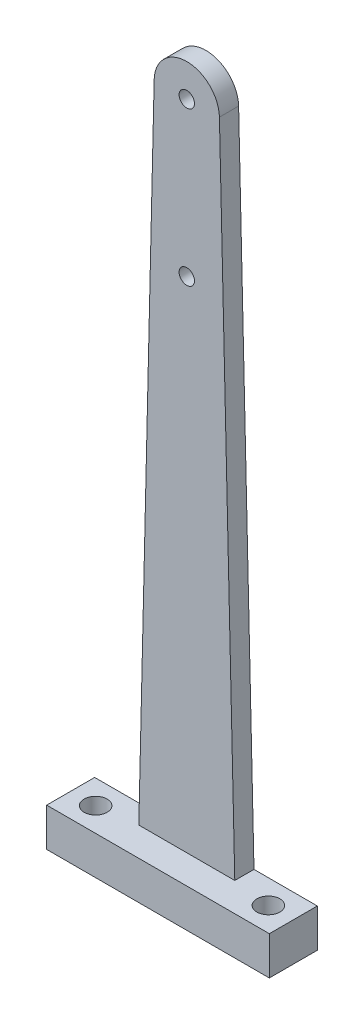
ISO-10303-21;
HEADER;
FILE_DESCRIPTION(('STEP AP214'),'2;1');
FILE_NAME('part.step','',(''),(''),'','','');
FILE_SCHEMA(('AUTOMOTIVE_DESIGN { 1 0 10303 214 1 1 1 1 }'));
ENDSEC;
DATA;
#1=APPLICATION_CONTEXT('core data for automotive mechanical design processes');
#2=APPLICATION_PROTOCOL_DEFINITION('international standard','automotive_design',2000,#1);
#3=PRODUCT_CONTEXT('',#1,'mechanical');
#4=PRODUCT('Part','Part','',(#3));
#5=PRODUCT_RELATED_PRODUCT_CATEGORY('part','',(#4));
#6=PRODUCT_DEFINITION_FORMATION('','',#4);
#7=PRODUCT_DEFINITION_CONTEXT('part definition',#1,'design');
#8=PRODUCT_DEFINITION('design','',#6,#7);
#9=PRODUCT_DEFINITION_SHAPE('','',#8);
#10=(LENGTH_UNIT() NAMED_UNIT(*) SI_UNIT(.MILLI.,.METRE.));
#11=(NAMED_UNIT(*) PLANE_ANGLE_UNIT() SI_UNIT($,.RADIAN.));
#12=(NAMED_UNIT(*) SI_UNIT($,.STERADIAN.) SOLID_ANGLE_UNIT());
#13=UNCERTAINTY_MEASURE_WITH_UNIT(LENGTH_MEASURE(1.E-05),#10,'distance_accuracy_value','');
#14=(GEOMETRIC_REPRESENTATION_CONTEXT(3) GLOBAL_UNCERTAINTY_ASSIGNED_CONTEXT((#13)) GLOBAL_UNIT_ASSIGNED_CONTEXT((#10,
#11,#12)) REPRESENTATION_CONTEXT('',''));
#15=CARTESIAN_POINT('',(0.,0.,0.));
#16=DIRECTION('',(0.,0.,1.));
#17=DIRECTION('',(1.,0.,0.));
#18=AXIS2_PLACEMENT_3D('',#15,#16,#17);
#19=CARTESIAN_POINT('',(-67.,-127.353946086128,5.));
#20=DIRECTION('',(0.,0.,-1.));
#21=DIRECTION('',(-1.,0.,0.));
#22=AXIS2_PLACEMENT_3D('',#19,#20,#21);
#23=PLANE('',#22);
#24=CARTESIAN_POINT('',(-67.,-127.353946086128,5.));
#25=DIRECTION('',(0.,0.,1.));
#26=DIRECTION('',(1.,0.,0.));
#27=AXIS2_PLACEMENT_3D('',#24,#25,#26);
#28=CIRCLE('',#27,2.);
#29=CARTESIAN_POINT('',(-65.,-127.353946086128,5.));
#30=VERTEX_POINT('',#29);
#31=EDGE_CURVE('E143',#30,#30,#28,.T.);
#32=ORIENTED_EDGE('',*,*,#31,.F.);
#33=EDGE_LOOP('',(#32));
#34=FACE_BOUND('',#33,.T.);
#35=CARTESIAN_POINT('',(-67.,-167.353946086128,5.));
#36=DIRECTION('',(0.,0.,1.));
#37=DIRECTION('',(1.,0.,0.));
#38=AXIS2_PLACEMENT_3D('',#35,#36,#37);
#39=CIRCLE('',#38,2.);
#40=CARTESIAN_POINT('',(-65.,-167.353946086128,5.));
#41=VERTEX_POINT('',#40);
#42=EDGE_CURVE('E149',#41,#41,#39,.T.);
#43=ORIENTED_EDGE('',*,*,#42,.F.);
#44=EDGE_LOOP('',(#43));
#45=FACE_BOUND('',#44,.T.);
#46=DIRECTION('',(-1.,0.,0.));
#47=VECTOR('',#46,1.);
#48=CARTESIAN_POINT('',(-67.,-297.353946086128,5.));
#49=LINE('',#48,#47);
#50=CARTESIAN_POINT('',(-54.5,-297.353946086128,5.));
#51=VERTEX_POINT('',#50);
#52=CARTESIAN_POINT('',(-79.5,-297.353946086128,5.));
#53=VERTEX_POINT('',#52);
#54=EDGE_CURVE('E139',#51,#53,#49,.T.);
#55=ORIENTED_EDGE('',*,*,#54,.F.);
#56=DIRECTION('',(-0.0235090899377256,0.999723623153069,0.));
#57=VECTOR('',#56,1.);
#58=CARTESIAN_POINT('',(-58.5023492031989,-127.154118821657,5.));
#59=LINE('',#58,#57);
#60=CARTESIAN_POINT('',(-58.5023492031989,-127.154118821657,5.));
#61=VERTEX_POINT('',#60);
#62=EDGE_CURVE('E49',#51,#61,#59,.T.);
#63=ORIENTED_EDGE('',*,*,#62,.T.);
#64=CARTESIAN_POINT('',(-67.,-127.353946086128,5.));
#65=DIRECTION('',(0.,0.,1.));
#66=DIRECTION('',(-1.,0.,0.));
#67=AXIS2_PLACEMENT_3D('',#64,#65,#66);
#68=CIRCLE('',#67,8.5);
#69=CARTESIAN_POINT('',(-75.4976507968011,-127.154118821657,5.));
#70=VERTEX_POINT('',#69);
#71=EDGE_CURVE('E155',#61,#70,#68,.T.);
#72=ORIENTED_EDGE('',*,*,#71,.T.);
#73=DIRECTION('',(-0.0235090899377256,-0.999723623153069,0.));
#74=VECTOR('',#73,1.);
#75=CARTESIAN_POINT('',(-75.4976507968011,-127.154118821657,5.));
#76=LINE('',#75,#74);
#77=EDGE_CURVE('E89',#70,#53,#76,.T.);
#78=ORIENTED_EDGE('',*,*,#77,.T.);
#79=EDGE_LOOP('',(#55,#63,#72,#78));
#80=FACE_BOUND('',#79,.T.);
#81=ADVANCED_FACE('F32',(#34,#45,#80),#23,.F.);
#82=CARTESIAN_POINT('',(-67.,-127.353946086128,0.));
#83=DIRECTION('',(0.,0.,-1.));
#84=DIRECTION('',(-1.,0.,0.));
#85=AXIS2_PLACEMENT_3D('',#82,#83,#84);
#86=PLANE('',#85);
#87=CARTESIAN_POINT('',(-67.,-167.353946086128,0.));
#88=DIRECTION('',(0.,0.,1.));
#89=DIRECTION('',(1.,0.,0.));
#90=AXIS2_PLACEMENT_3D('',#87,#88,#89);
#91=CIRCLE('',#90,2.);
#92=CARTESIAN_POINT('',(-65.,-167.353946086128,0.));
#93=VERTEX_POINT('',#92);
#94=EDGE_CURVE('E146',#93,#93,#91,.T.);
#95=ORIENTED_EDGE('',*,*,#94,.T.);
#96=EDGE_LOOP('',(#95));
#97=FACE_BOUND('',#96,.T.);
#98=CARTESIAN_POINT('',(-67.,-127.353946086128,0.));
#99=DIRECTION('',(0.,0.,1.));
#100=DIRECTION('',(-1.,0.,0.));
#101=AXIS2_PLACEMENT_3D('',#98,#99,#100);
#102=CIRCLE('',#101,8.5);
#103=CARTESIAN_POINT('',(-58.5023492031989,-127.154118821657,0.));
#104=VERTEX_POINT('',#103);
#105=CARTESIAN_POINT('',(-75.4976507968011,-127.154118821657,0.));
#106=VERTEX_POINT('',#105);
#107=EDGE_CURVE('E152',#104,#106,#102,.T.);
#108=ORIENTED_EDGE('',*,*,#107,.F.);
#109=DIRECTION('',(-0.0235090899377256,0.999723623153069,0.));
#110=VECTOR('',#109,1.);
#111=CARTESIAN_POINT('',(-58.5023492031989,-127.154118821657,0.));
#112=LINE('',#111,#110);
#113=CARTESIAN_POINT('',(-54.5,-297.353946086128,0.));
#114=VERTEX_POINT('',#113);
#115=EDGE_CURVE('E82',#114,#104,#112,.T.);
#116=ORIENTED_EDGE('',*,*,#115,.F.);
#117=DIRECTION('',(-1.,0.,0.));
#118=VECTOR('',#117,1.);
#119=CARTESIAN_POINT('',(-54.5,-297.353946086128,0.));
#120=LINE('',#119,#118);
#121=CARTESIAN_POINT('',(-38.,-297.353946086128,0.));
#122=VERTEX_POINT('',#121);
#123=EDGE_CURVE('E174',#122,#114,#120,.T.);
#124=ORIENTED_EDGE('',*,*,#123,.F.);
#125=DIRECTION('',(0.,1.,0.));
#126=VECTOR('',#125,1.);
#127=CARTESIAN_POINT('',(-38.,-297.353946086128,0.));
#128=LINE('',#127,#126);
#129=CARTESIAN_POINT('',(-38.,-307.353946086128,0.));
#130=VERTEX_POINT('',#129);
#131=EDGE_CURVE('E171',#130,#122,#128,.T.);
#132=ORIENTED_EDGE('',*,*,#131,.F.);
#133=DIRECTION('',(1.,0.,0.));
#134=VECTOR('',#133,1.);
#135=CARTESIAN_POINT('',(-96.,-307.353946086128,0.));
#136=LINE('',#135,#134);
#137=CARTESIAN_POINT('',(-96.,-307.353946086128,0.));
#138=VERTEX_POINT('',#137);
#139=EDGE_CURVE('E168',#138,#130,#136,.T.);
#140=ORIENTED_EDGE('',*,*,#139,.F.);
#141=DIRECTION('',(0.,-1.,0.));
#142=VECTOR('',#141,1.);
#143=CARTESIAN_POINT('',(-96.,-297.353946086128,0.));
#144=LINE('',#143,#142);
#145=CARTESIAN_POINT('',(-96.,-297.353946086128,0.));
#146=VERTEX_POINT('',#145);
#147=EDGE_CURVE('E166',#146,#138,#144,.T.);
#148=ORIENTED_EDGE('',*,*,#147,.F.);
#149=DIRECTION('',(-1.,0.,0.));
#150=VECTOR('',#149,1.);
#151=CARTESIAN_POINT('',(-96.,-297.353946086128,0.));
#152=LINE('',#151,#150);
#153=CARTESIAN_POINT('',(-79.5,-297.353946086128,0.));
#154=VERTEX_POINT('',#153);
#155=EDGE_CURVE('E110',#154,#146,#152,.T.);
#156=ORIENTED_EDGE('',*,*,#155,.F.);
#157=DIRECTION('',(-0.0235090899377256,-0.999723623153069,0.));
#158=VECTOR('',#157,1.);
#159=CARTESIAN_POINT('',(-75.4976507968011,-127.154118821657,0.));
#160=LINE('',#159,#158);
#161=EDGE_CURVE('E162',#106,#154,#160,.T.);
#162=ORIENTED_EDGE('',*,*,#161,.F.);
#163=EDGE_LOOP('',(#108,#116,#124,#132,#140,#148,#156,#162));
#164=FACE_BOUND('',#163,.T.);
#165=CARTESIAN_POINT('',(-67.,-127.353946086128,0.));
#166=DIRECTION('',(0.,0.,1.));
#167=DIRECTION('',(1.,0.,0.));
#168=AXIS2_PLACEMENT_3D('',#165,#166,#167);
#169=CIRCLE('',#168,2.);
#170=CARTESIAN_POINT('',(-65.,-127.353946086128,0.));
#171=VERTEX_POINT('',#170);
#172=EDGE_CURVE('E142',#171,#171,#169,.T.);
#173=ORIENTED_EDGE('',*,*,#172,.T.);
#174=EDGE_LOOP('',(#173));
#175=FACE_BOUND('',#174,.T.);
#176=ADVANCED_FACE('F187',(#97,#164,#175),#86,.T.);
#177=CARTESIAN_POINT('',(-67.,-127.353946086128,5.));
#178=DIRECTION('',(0.,0.,-1.));
#179=DIRECTION('',(-1.,0.,0.));
#180=AXIS2_PLACEMENT_3D('',#177,#178,#179);
#181=CYLINDRICAL_SURFACE('',#180,8.5);
#182=ORIENTED_EDGE('',*,*,#107,.T.);
#183=DIRECTION('',(0.,0.,-1.));
#184=VECTOR('',#183,1.);
#185=CARTESIAN_POINT('',(-75.4976507968011,-127.154118821657,5.));
#186=LINE('',#185,#184);
#187=EDGE_CURVE('E11',#70,#106,#186,.T.);
#188=ORIENTED_EDGE('',*,*,#187,.F.);
#189=ORIENTED_EDGE('',*,*,#71,.F.);
#190=DIRECTION('',(0.,0.,-1.));
#191=VECTOR('',#190,1.);
#192=CARTESIAN_POINT('',(-58.5023492031989,-127.154118821657,5.));
#193=LINE('',#192,#191);
#194=EDGE_CURVE('E159',#61,#104,#193,.T.);
#195=ORIENTED_EDGE('',*,*,#194,.T.);
#196=EDGE_LOOP('',(#182,#188,#189,#195));
#197=FACE_BOUND('',#196,.T.);
#198=ADVANCED_FACE('F34',(#197),#181,.T.);
#199=CARTESIAN_POINT('',(-75.4976507968011,-127.154118821657,5.));
#200=DIRECTION('',(0.999723623153069,-0.0235090899377256,0.));
#201=DIRECTION('',(0.0235090899377256,0.999723623153069,0.));
#202=AXIS2_PLACEMENT_3D('',#199,#200,#201);
#203=PLANE('',#202);
#204=ORIENTED_EDGE('',*,*,#161,.T.);
#205=DIRECTION('',(0.,0.,-1.));
#206=VECTOR('',#205,1.);
#207=CARTESIAN_POINT('',(-79.5,-297.353946086128,5.));
#208=LINE('',#207,#206);
#209=EDGE_CURVE('E41',#53,#154,#208,.T.);
#210=ORIENTED_EDGE('',*,*,#209,.F.);
#211=ORIENTED_EDGE('',*,*,#77,.F.);
#212=ORIENTED_EDGE('',*,*,#187,.T.);
#213=EDGE_LOOP('',(#204,#210,#211,#212));
#214=FACE_BOUND('',#213,.T.);
#215=ADVANCED_FACE('F183',(#214),#203,.F.);
#216=CARTESIAN_POINT('',(-96.,-297.353946086128,5.));
#217=DIRECTION('',(1.,0.,0.));
#218=DIRECTION('',(0.,0.,-1.));
#219=AXIS2_PLACEMENT_3D('',#216,#217,#218);
#220=PLANE('',#219);
#221=DIRECTION('',(0.,0.,-1.));
#222=VECTOR('',#221,1.);
#223=CARTESIAN_POINT('',(-96.,-297.353946086128,5.));
#224=LINE('',#223,#222);
#225=CARTESIAN_POINT('',(-96.,-297.353946086128,12.5));
#226=VERTEX_POINT('',#225);
#227=EDGE_CURVE('E104',#226,#146,#224,.T.);
#228=ORIENTED_EDGE('',*,*,#227,.T.);
#229=ORIENTED_EDGE('',*,*,#147,.T.);
#230=DIRECTION('',(0.,0.,-1.));
#231=VECTOR('',#230,1.);
#232=CARTESIAN_POINT('',(-96.,-307.353946086128,5.));
#233=LINE('',#232,#231);
#234=CARTESIAN_POINT('',(-96.,-307.353946086128,12.5));
#235=VERTEX_POINT('',#234);
#236=EDGE_CURVE('E114',#235,#138,#233,.T.);
#237=ORIENTED_EDGE('',*,*,#236,.F.);
#238=DIRECTION('',(0.,-1.,0.));
#239=VECTOR('',#238,1.);
#240=CARTESIAN_POINT('',(-96.,-297.353946086128,12.5));
#241=LINE('',#240,#239);
#242=EDGE_CURVE('E117',#226,#235,#241,.T.);
#243=ORIENTED_EDGE('',*,*,#242,.F.);
#244=EDGE_LOOP('',(#228,#229,#237,#243));
#245=FACE_BOUND('',#244,.T.);
#246=ADVANCED_FACE('F118',(#245),#220,.F.);
#247=CARTESIAN_POINT('',(-96.,-307.353946086128,5.));
#248=DIRECTION('',(0.,1.,0.));
#249=DIRECTION('',(0.,0.,1.));
#250=AXIS2_PLACEMENT_3D('',#247,#248,#249);
#251=PLANE('',#250);
#252=CARTESIAN_POINT('',(-89.5,-307.353946086128,6.25));
#253=DIRECTION('',(0.,1.,0.));
#254=DIRECTION('',(0.,0.,1.));
#255=AXIS2_PLACEMENT_3D('',#252,#253,#254);
#256=CIRCLE('',#255,3.00000000000001);
#257=CARTESIAN_POINT('',(-89.5,-307.353946086128,9.25000000000001));
#258=VERTEX_POINT('',#257);
#259=EDGE_CURVE('E128',#258,#258,#256,.T.);
#260=ORIENTED_EDGE('',*,*,#259,.T.);
#261=EDGE_LOOP('',(#260));
#262=FACE_BOUND('',#261,.T.);
#263=CARTESIAN_POINT('',(-44.5,-307.353946086128,6.25));
#264=DIRECTION('',(0.,1.,0.));
#265=DIRECTION('',(0.,0.,1.));
#266=AXIS2_PLACEMENT_3D('',#263,#264,#265);
#267=CIRCLE('',#266,3.);
#268=CARTESIAN_POINT('',(-44.5,-307.353946086128,9.25));
#269=VERTEX_POINT('',#268);
#270=EDGE_CURVE('E240',#269,#269,#267,.T.);
#271=ORIENTED_EDGE('',*,*,#270,.T.);
#272=EDGE_LOOP('',(#271));
#273=FACE_BOUND('',#272,.T.);
#274=ORIENTED_EDGE('',*,*,#236,.T.);
#275=ORIENTED_EDGE('',*,*,#139,.T.);
#276=DIRECTION('',(0.,0.,-1.));
#277=VECTOR('',#276,1.);
#278=CARTESIAN_POINT('',(-38.,-307.353946086128,5.));
#279=LINE('',#278,#277);
#280=CARTESIAN_POINT('',(-38.,-307.353946086128,12.5));
#281=VERTEX_POINT('',#280);
#282=EDGE_CURVE('E181',#281,#130,#279,.T.);
#283=ORIENTED_EDGE('',*,*,#282,.F.);
#284=DIRECTION('',(1.,0.,0.));
#285=VECTOR('',#284,1.);
#286=CARTESIAN_POINT('',(-96.,-307.353946086128,12.5));
#287=LINE('',#286,#285);
#288=EDGE_CURVE('E122',#235,#281,#287,.T.);
#289=ORIENTED_EDGE('',*,*,#288,.F.);
#290=EDGE_LOOP('',(#274,#275,#283,#289));
#291=FACE_BOUND('',#290,.T.);
#292=ADVANCED_FACE('F193',(#262,#273,#291),#251,.F.);
#293=CARTESIAN_POINT('',(-38.,-297.353946086128,5.));
#294=DIRECTION('',(-1.,0.,0.));
#295=DIRECTION('',(0.,0.,1.));
#296=AXIS2_PLACEMENT_3D('',#293,#294,#295);
#297=PLANE('',#296);
#298=ORIENTED_EDGE('',*,*,#282,.T.);
#299=ORIENTED_EDGE('',*,*,#131,.T.);
#300=DIRECTION('',(0.,0.,-1.));
#301=VECTOR('',#300,1.);
#302=CARTESIAN_POINT('',(-38.,-297.353946086128,5.));
#303=LINE('',#302,#301);
#304=CARTESIAN_POINT('',(-38.,-297.353946086128,12.5));
#305=VERTEX_POINT('',#304);
#306=EDGE_CURVE('E179',#305,#122,#303,.T.);
#307=ORIENTED_EDGE('',*,*,#306,.F.);
#308=DIRECTION('',(0.,1.,0.));
#309=VECTOR('',#308,1.);
#310=CARTESIAN_POINT('',(-38.,-307.353946086128,12.5));
#311=LINE('',#310,#309);
#312=EDGE_CURVE('E127',#281,#305,#311,.T.);
#313=ORIENTED_EDGE('',*,*,#312,.F.);
#314=EDGE_LOOP('',(#298,#299,#307,#313));
#315=FACE_BOUND('',#314,.T.);
#316=ADVANCED_FACE('F195',(#315),#297,.F.);
#317=CARTESIAN_POINT('',(-54.5,-297.353946086128,5.));
#318=DIRECTION('',(0.,-1.,0.));
#319=DIRECTION('',(0.,0.,-1.));
#320=AXIS2_PLACEMENT_3D('',#317,#318,#319);
#321=PLANE('',#320);
#322=CARTESIAN_POINT('',(-89.5,-297.353946086128,6.25));
#323=DIRECTION('',(0.,1.,0.));
#324=DIRECTION('',(0.,0.,1.));
#325=AXIS2_PLACEMENT_3D('',#322,#323,#324);
#326=CIRCLE('',#325,3.00000000000001);
#327=CARTESIAN_POINT('',(-89.5,-297.353946086128,9.25000000000001));
#328=VERTEX_POINT('',#327);
#329=EDGE_CURVE('E131',#328,#328,#326,.T.);
#330=ORIENTED_EDGE('',*,*,#329,.F.);
#331=EDGE_LOOP('',(#330));
#332=FACE_BOUND('',#331,.T.);
#333=CARTESIAN_POINT('',(-44.5,-297.353946086128,6.25));
#334=DIRECTION('',(0.,1.,0.));
#335=DIRECTION('',(0.,0.,1.));
#336=AXIS2_PLACEMENT_3D('',#333,#334,#335);
#337=CIRCLE('',#336,3.);
#338=CARTESIAN_POINT('',(-44.5,-297.353946086128,9.25));
#339=VERTEX_POINT('',#338);
#340=EDGE_CURVE('E134',#339,#339,#337,.T.);
#341=ORIENTED_EDGE('',*,*,#340,.F.);
#342=EDGE_LOOP('',(#341));
#343=FACE_BOUND('',#342,.T.);
#344=ORIENTED_EDGE('',*,*,#306,.T.);
#345=ORIENTED_EDGE('',*,*,#123,.T.);
#346=DIRECTION('',(0.,0.,-1.));
#347=VECTOR('',#346,1.);
#348=CARTESIAN_POINT('',(-54.5,-297.353946086128,5.));
#349=LINE('',#348,#347);
#350=EDGE_CURVE('E78',#51,#114,#349,.T.);
#351=ORIENTED_EDGE('',*,*,#350,.F.);
#352=ORIENTED_EDGE('',*,*,#54,.T.);
#353=ORIENTED_EDGE('',*,*,#209,.T.);
#354=ORIENTED_EDGE('',*,*,#155,.T.);
#355=ORIENTED_EDGE('',*,*,#227,.F.);
#356=DIRECTION('',(-1.,0.,0.));
#357=VECTOR('',#356,1.);
#358=CARTESIAN_POINT('',(-38.,-297.353946086128,12.5));
#359=LINE('',#358,#357);
#360=EDGE_CURVE('E108',#305,#226,#359,.T.);
#361=ORIENTED_EDGE('',*,*,#360,.F.);
#362=EDGE_LOOP('',(#344,#345,#351,#352,#353,#354,#355,#361));
#363=FACE_BOUND('',#362,.T.);
#364=ADVANCED_FACE('F106',(#332,#343,#363),#321,.F.);
#365=CARTESIAN_POINT('',(-58.5023492031989,-127.154118821657,5.));
#366=DIRECTION('',(-0.999723623153069,-0.0235090899377256,0.));
#367=DIRECTION('',(0.0235090899377256,-0.999723623153069,0.));
#368=AXIS2_PLACEMENT_3D('',#365,#366,#367);
#369=PLANE('',#368);
#370=ORIENTED_EDGE('',*,*,#115,.T.);
#371=ORIENTED_EDGE('',*,*,#194,.F.);
#372=ORIENTED_EDGE('',*,*,#62,.F.);
#373=ORIENTED_EDGE('',*,*,#350,.T.);
#374=EDGE_LOOP('',(#370,#371,#372,#373));
#375=FACE_BOUND('',#374,.T.);
#376=ADVANCED_FACE('F198',(#375),#369,.F.);
#377=CARTESIAN_POINT('',(-67.,-167.353946086128,5.));
#378=DIRECTION('',(0.,0.,-1.));
#379=DIRECTION('',(-1.,0.,0.));
#380=AXIS2_PLACEMENT_3D('',#377,#378,#379);
#381=CYLINDRICAL_SURFACE('',#380,2.);
#382=ORIENTED_EDGE('',*,*,#42,.T.);
#383=EDGE_LOOP('',(#382));
#384=FACE_BOUND('',#383,.T.);
#385=ORIENTED_EDGE('',*,*,#94,.F.);
#386=EDGE_LOOP('',(#385));
#387=FACE_BOUND('',#386,.T.);
#388=ADVANCED_FACE('F200',(#384,#387),#381,.F.);
#389=CARTESIAN_POINT('',(-67.,-127.353946086128,5.));
#390=DIRECTION('',(0.,0.,-1.));
#391=DIRECTION('',(-1.,0.,0.));
#392=AXIS2_PLACEMENT_3D('',#389,#390,#391);
#393=CYLINDRICAL_SURFACE('',#392,2.);
#394=ORIENTED_EDGE('',*,*,#31,.T.);
#395=EDGE_LOOP('',(#394));
#396=FACE_BOUND('',#395,.T.);
#397=ORIENTED_EDGE('',*,*,#172,.F.);
#398=EDGE_LOOP('',(#397));
#399=FACE_BOUND('',#398,.T.);
#400=ADVANCED_FACE('F206',(#396,#399),#393,.F.);
#401=CARTESIAN_POINT('',(0.,0.,12.5));
#402=DIRECTION('',(0.,0.,1.));
#403=DIRECTION('',(1.,0.,0.));
#404=AXIS2_PLACEMENT_3D('',#401,#402,#403);
#405=PLANE('',#404);
#406=ORIENTED_EDGE('',*,*,#360,.T.);
#407=ORIENTED_EDGE('',*,*,#242,.T.);
#408=ORIENTED_EDGE('',*,*,#288,.T.);
#409=ORIENTED_EDGE('',*,*,#312,.T.);
#410=EDGE_LOOP('',(#406,#407,#408,#409));
#411=FACE_BOUND('',#410,.T.);
#412=ADVANCED_FACE('F125',(#411),#405,.T.);
#413=CARTESIAN_POINT('',(-44.5,-307.353946086128,6.25));
#414=DIRECTION('',(0.,1.,0.));
#415=DIRECTION('',(0.,0.,1.));
#416=AXIS2_PLACEMENT_3D('',#413,#414,#415);
#417=CYLINDRICAL_SURFACE('',#416,3.);
#418=ORIENTED_EDGE('',*,*,#270,.F.);
#419=EDGE_LOOP('',(#418));
#420=FACE_BOUND('',#419,.T.);
#421=ORIENTED_EDGE('',*,*,#340,.T.);
#422=EDGE_LOOP('',(#421));
#423=FACE_BOUND('',#422,.T.);
#424=ADVANCED_FACE('F227',(#420,#423),#417,.F.);
#425=CARTESIAN_POINT('',(-89.5,-307.353946086128,6.25));
#426=DIRECTION('',(0.,1.,0.));
#427=DIRECTION('',(0.,0.,1.));
#428=AXIS2_PLACEMENT_3D('',#425,#426,#427);
#429=CYLINDRICAL_SURFACE('',#428,3.00000000000001);
#430=ORIENTED_EDGE('',*,*,#259,.F.);
#431=EDGE_LOOP('',(#430));
#432=FACE_BOUND('',#431,.T.);
#433=ORIENTED_EDGE('',*,*,#329,.T.);
#434=EDGE_LOOP('',(#433));
#435=FACE_BOUND('',#434,.T.);
#436=ADVANCED_FACE('F230',(#432,#435),#429,.F.);
#437=CLOSED_SHELL('',(#81,#176,#198,#215,#246,#292,#316,#364,#376,#388,#400,#412,#424,#436));
#438=MANIFOLD_SOLID_BREP('B2',#437);
#439=ADVANCED_BREP_SHAPE_REPRESENTATION('',(#18,#438),#14);
#440=SHAPE_DEFINITION_REPRESENTATION(#9,#439);
ENDSEC;
END-ISO-10303-21;
